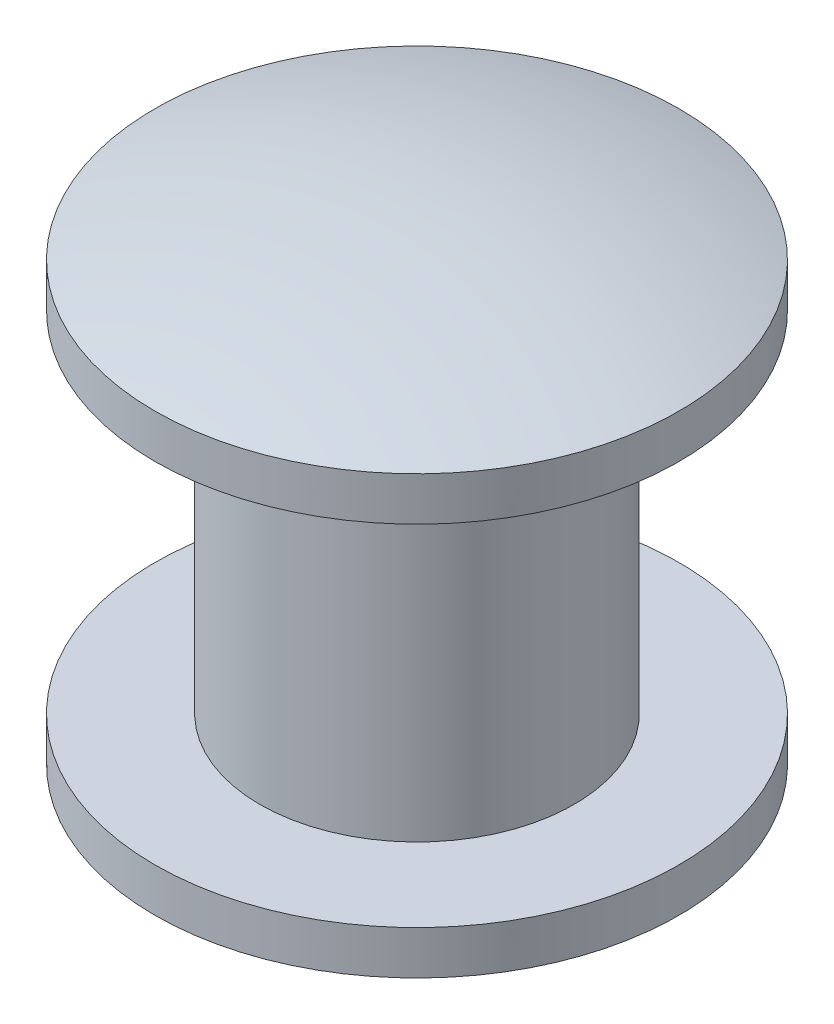
ISO-10303-21;
HEADER;
FILE_DESCRIPTION(('STEP AP214'),'2;1');
FILE_NAME('part.step','',(''),(''),'','','');
FILE_SCHEMA(('AUTOMOTIVE_DESIGN { 1 0 10303 214 1 1 1 1 }'));
ENDSEC;
DATA;
#1=APPLICATION_CONTEXT('core data for automotive mechanical design processes');
#2=APPLICATION_PROTOCOL_DEFINITION('international standard','automotive_design',2000,#1);
#3=PRODUCT_CONTEXT('',#1,'mechanical');
#4=PRODUCT('Part','Part','',(#3));
#5=PRODUCT_RELATED_PRODUCT_CATEGORY('part','',(#4));
#6=PRODUCT_DEFINITION_FORMATION('','',#4);
#7=PRODUCT_DEFINITION_CONTEXT('part definition',#1,'design');
#8=PRODUCT_DEFINITION('design','',#6,#7);
#9=PRODUCT_DEFINITION_SHAPE('','',#8);
#10=(LENGTH_UNIT() NAMED_UNIT(*) SI_UNIT(.MILLI.,.METRE.));
#11=(NAMED_UNIT(*) PLANE_ANGLE_UNIT() SI_UNIT($,.RADIAN.));
#12=(NAMED_UNIT(*) SI_UNIT($,.STERADIAN.) SOLID_ANGLE_UNIT());
#13=UNCERTAINTY_MEASURE_WITH_UNIT(LENGTH_MEASURE(1.E-05),#10,'distance_accuracy_value','');
#14=(GEOMETRIC_REPRESENTATION_CONTEXT(3) GLOBAL_UNCERTAINTY_ASSIGNED_CONTEXT((#13)) GLOBAL_UNIT_ASSIGNED_CONTEXT((#10,
#11,#12)) REPRESENTATION_CONTEXT('',''));
#15=CARTESIAN_POINT('',(0.,0.,0.));
#16=DIRECTION('',(0.,0.,1.));
#17=DIRECTION('',(1.,0.,0.));
#18=AXIS2_PLACEMENT_3D('',#15,#16,#17);
#19=CARTESIAN_POINT('',(0.,-11.7475,0.));
#20=DIRECTION('',(0.,1.,0.));
#21=DIRECTION('',(0.,0.,-1.));
#22=AXIS2_PLACEMENT_3D('',#19,#20,#21);
#23=SPHERICAL_SURFACE('',#22,11.7475);
#24=CARTESIAN_POINT('',(0.,-0.635,0.));
#25=DIRECTION('',(0.,1.,0.));
#26=DIRECTION('',(0.,0.,1.));
#27=AXIS2_PLACEMENT_3D('',#24,#25,#26);
#28=CIRCLE('',#27,3.81);
#29=CARTESIAN_POINT('',(0.,-0.635,3.81));
#30=VERTEX_POINT('',#29);
#31=EDGE_CURVE('E10',#30,#30,#28,.T.);
#32=ORIENTED_EDGE('',*,*,#31,.T.);
#33=EDGE_LOOP('',(#32));
#34=FACE_BOUND('',#33,.T.);
#35=ADVANCED_FACE('F30',(#34),#23,.T.);
#36=CARTESIAN_POINT('',(0.,0.,0.));
#37=DIRECTION('',(0.,1.,0.));
#38=DIRECTION('',(0.,0.,1.));
#39=AXIS2_PLACEMENT_3D('',#36,#37,#38);
#40=CYLINDRICAL_SURFACE('',#39,3.81);
#41=ORIENTED_EDGE('',*,*,#31,.F.);
#42=EDGE_LOOP('',(#41));
#43=FACE_BOUND('',#42,.T.);
#44=CARTESIAN_POINT('',(0.,-1.27,0.));
#45=DIRECTION('',(0.,1.,0.));
#46=DIRECTION('',(0.,0.,1.));
#47=AXIS2_PLACEMENT_3D('',#44,#45,#46);
#48=CIRCLE('',#47,3.81);
#49=CARTESIAN_POINT('',(0.,-1.27,3.81));
#50=VERTEX_POINT('',#49);
#51=EDGE_CURVE('E36',#50,#50,#48,.T.);
#52=ORIENTED_EDGE('',*,*,#51,.T.);
#53=EDGE_LOOP('',(#52));
#54=FACE_BOUND('',#53,.T.);
#55=ADVANCED_FACE('F68',(#43,#54),#40,.T.);
#56=CARTESIAN_POINT('',(0.,-1.27,-2.286));
#57=DIRECTION('',(0.,1.,0.));
#58=DIRECTION('',(0.,0.,1.));
#59=AXIS2_PLACEMENT_3D('',#56,#57,#58);
#60=PLANE('',#59);
#61=ORIENTED_EDGE('',*,*,#51,.F.);
#62=EDGE_LOOP('',(#61));
#63=FACE_BOUND('',#62,.T.);
#64=CARTESIAN_POINT('',(0.,-1.27,0.));
#65=DIRECTION('',(0.,1.,0.));
#66=DIRECTION('',(0.,0.,1.));
#67=AXIS2_PLACEMENT_3D('',#64,#65,#66);
#68=CIRCLE('',#67,2.286);
#69=CARTESIAN_POINT('',(0.,-1.27,2.286));
#70=VERTEX_POINT('',#69);
#71=EDGE_CURVE('E40',#70,#70,#68,.T.);
#72=ORIENTED_EDGE('',*,*,#71,.T.);
#73=EDGE_LOOP('',(#72));
#74=FACE_BOUND('',#73,.T.);
#75=ADVANCED_FACE('F72',(#63,#74),#60,.F.);
#76=CARTESIAN_POINT('',(0.,0.,0.));
#77=DIRECTION('',(0.,1.,0.));
#78=DIRECTION('',(0.,0.,1.));
#79=AXIS2_PLACEMENT_3D('',#76,#77,#78);
#80=CYLINDRICAL_SURFACE('',#79,2.286);
#81=ORIENTED_EDGE('',*,*,#71,.F.);
#82=EDGE_LOOP('',(#81));
#83=FACE_BOUND('',#82,.T.);
#84=CARTESIAN_POINT('',(0.,-6.35,0.));
#85=DIRECTION('',(0.,1.,0.));
#86=DIRECTION('',(0.,0.,1.));
#87=AXIS2_PLACEMENT_3D('',#84,#85,#86);
#88=CIRCLE('',#87,2.286);
#89=CARTESIAN_POINT('',(0.,-6.35,2.286));
#90=VERTEX_POINT('',#89);
#91=EDGE_CURVE('E44',#90,#90,#88,.T.);
#92=ORIENTED_EDGE('',*,*,#91,.T.);
#93=EDGE_LOOP('',(#92));
#94=FACE_BOUND('',#93,.T.);
#95=ADVANCED_FACE('F77',(#83,#94),#80,.T.);
#96=CARTESIAN_POINT('',(0.,-6.35,-3.81));
#97=DIRECTION('',(0.,-1.,0.));
#98=DIRECTION('',(0.,0.,-1.));
#99=AXIS2_PLACEMENT_3D('',#96,#97,#98);
#100=PLANE('',#99);
#101=ORIENTED_EDGE('',*,*,#91,.F.);
#102=EDGE_LOOP('',(#101));
#103=FACE_BOUND('',#102,.T.);
#104=CARTESIAN_POINT('',(0.,-6.35,0.));
#105=DIRECTION('',(0.,1.,0.));
#106=DIRECTION('',(0.,0.,1.));
#107=AXIS2_PLACEMENT_3D('',#104,#105,#106);
#108=CIRCLE('',#107,3.81);
#109=CARTESIAN_POINT('',(0.,-6.35,3.81));
#110=VERTEX_POINT('',#109);
#111=EDGE_CURVE('E49',#110,#110,#108,.T.);
#112=ORIENTED_EDGE('',*,*,#111,.T.);
#113=EDGE_LOOP('',(#112));
#114=FACE_BOUND('',#113,.T.);
#115=ADVANCED_FACE('F64',(#103,#114),#100,.F.);
#116=CARTESIAN_POINT('',(0.,0.,0.));
#117=DIRECTION('',(0.,1.,0.));
#118=DIRECTION('',(0.,0.,1.));
#119=AXIS2_PLACEMENT_3D('',#116,#117,#118);
#120=CYLINDRICAL_SURFACE('',#119,3.81);
#121=ORIENTED_EDGE('',*,*,#111,.F.);
#122=EDGE_LOOP('',(#121));
#123=FACE_BOUND('',#122,.T.);
#124=CARTESIAN_POINT('',(0.,-6.985,0.));
#125=DIRECTION('',(0.,1.,0.));
#126=DIRECTION('',(0.,0.,1.));
#127=AXIS2_PLACEMENT_3D('',#124,#125,#126);
#128=CIRCLE('',#127,3.81);
#129=CARTESIAN_POINT('',(0.,-6.985,3.81));
#130=VERTEX_POINT('',#129);
#131=EDGE_CURVE('E52',#130,#130,#128,.T.);
#132=ORIENTED_EDGE('',*,*,#131,.T.);
#133=EDGE_LOOP('',(#132));
#134=FACE_BOUND('',#133,.T.);
#135=ADVANCED_FACE('F56',(#123,#134),#120,.T.);
#136=CARTESIAN_POINT('',(0.,4.1275,0.));
#137=DIRECTION('',(0.,1.,0.));
#138=DIRECTION('',(0.,0.,-1.));
#139=AXIS2_PLACEMENT_3D('',#136,#137,#138);
#140=SPHERICAL_SURFACE('',#139,11.7475);
#141=ORIENTED_EDGE('',*,*,#131,.F.);
#142=EDGE_LOOP('',(#141));
#143=FACE_BOUND('',#142,.T.);
#144=ADVANCED_FACE('F58',(#143),#140,.T.);
#145=CLOSED_SHELL('',(#35,#55,#75,#95,#115,#135,#144));
#146=MANIFOLD_SOLID_BREP('B2',#145);
#147=ADVANCED_BREP_SHAPE_REPRESENTATION('',(#18,#146),#14);
#148=SHAPE_DEFINITION_REPRESENTATION(#9,#147);
ENDSEC;
END-ISO-10303-21;
